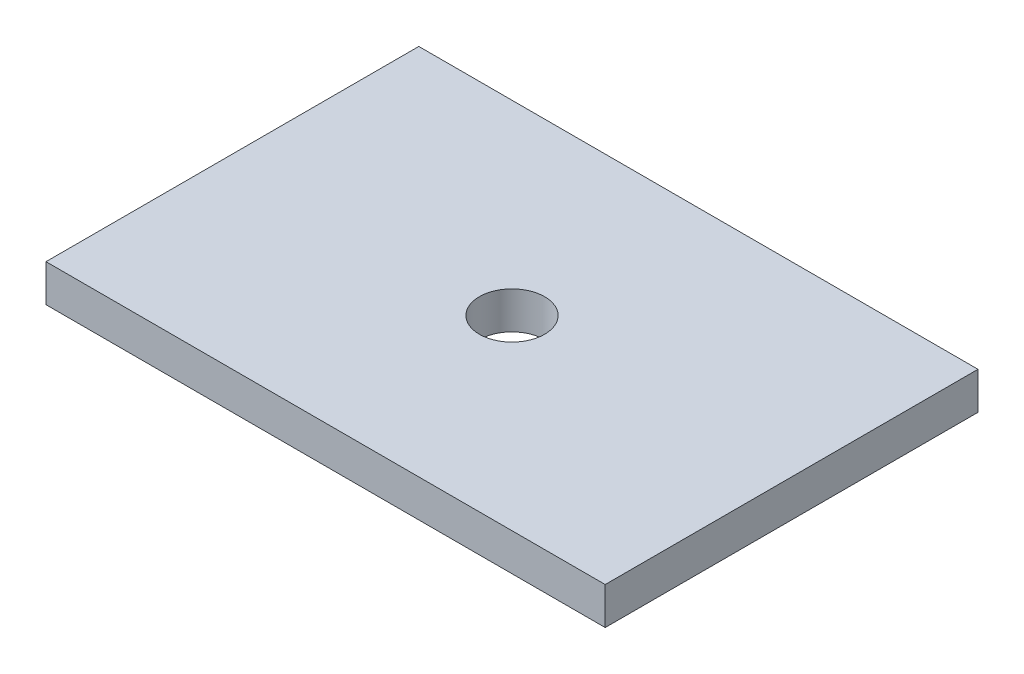
ISO-10303-21;
HEADER;
FILE_DESCRIPTION(('STEP AP214'),'2;1');
FILE_NAME('part.step','',(''),(''),'','','');
FILE_SCHEMA(('AUTOMOTIVE_DESIGN { 1 0 10303 214 1 1 1 1 }'));
ENDSEC;
DATA;
#1=APPLICATION_CONTEXT('core data for automotive mechanical design processes');
#2=APPLICATION_PROTOCOL_DEFINITION('international standard','automotive_design',2000,#1);
#3=PRODUCT_CONTEXT('',#1,'mechanical');
#4=PRODUCT('Part','Part','',(#3));
#5=PRODUCT_RELATED_PRODUCT_CATEGORY('part','',(#4));
#6=PRODUCT_DEFINITION_FORMATION('','',#4);
#7=PRODUCT_DEFINITION_CONTEXT('part definition',#1,'design');
#8=PRODUCT_DEFINITION('design','',#6,#7);
#9=PRODUCT_DEFINITION_SHAPE('','',#8);
#10=(LENGTH_UNIT() NAMED_UNIT(*) SI_UNIT(.MILLI.,.METRE.));
#11=(NAMED_UNIT(*) PLANE_ANGLE_UNIT() SI_UNIT($,.RADIAN.));
#12=(NAMED_UNIT(*) SI_UNIT($,.STERADIAN.) SOLID_ANGLE_UNIT());
#13=UNCERTAINTY_MEASURE_WITH_UNIT(LENGTH_MEASURE(1.E-05),#10,'distance_accuracy_value','');
#14=(GEOMETRIC_REPRESENTATION_CONTEXT(3) GLOBAL_UNCERTAINTY_ASSIGNED_CONTEXT((#13)) GLOBAL_UNIT_ASSIGNED_CONTEXT((#10,
#11,#12)) REPRESENTATION_CONTEXT('',''));
#15=CARTESIAN_POINT('',(0.,0.,0.));
#16=DIRECTION('',(0.,0.,1.));
#17=DIRECTION('',(1.,0.,0.));
#18=AXIS2_PLACEMENT_3D('',#15,#16,#17);
#19=CARTESIAN_POINT('',(15.,2.,10.));
#20=DIRECTION('',(-1.,0.,0.));
#21=DIRECTION('',(0.,0.,1.));
#22=AXIS2_PLACEMENT_3D('',#19,#20,#21);
#23=PLANE('',#22);
#24=DIRECTION('',(0.,0.,-1.));
#25=VECTOR('',#24,1.);
#26=CARTESIAN_POINT('',(15.,0.,10.));
#27=LINE('',#26,#25);
#28=CARTESIAN_POINT('',(15.,0.,10.));
#29=VERTEX_POINT('',#28);
#30=CARTESIAN_POINT('',(15.,0.,-10.));
#31=VERTEX_POINT('',#30);
#32=EDGE_CURVE('E96',#29,#31,#27,.T.);
#33=ORIENTED_EDGE('',*,*,#32,.T.);
#34=DIRECTION('',(0.,-1.,0.));
#35=VECTOR('',#34,1.);
#36=CARTESIAN_POINT('',(15.,2.,-10.));
#37=LINE('',#36,#35);
#38=CARTESIAN_POINT('',(15.,2.,-10.));
#39=VERTEX_POINT('',#38);
#40=EDGE_CURVE('E11',#39,#31,#37,.T.);
#41=ORIENTED_EDGE('',*,*,#40,.F.);
#42=DIRECTION('',(0.,0.,-1.));
#43=VECTOR('',#42,1.);
#44=CARTESIAN_POINT('',(15.,2.,10.));
#45=LINE('',#44,#43);
#46=CARTESIAN_POINT('',(15.,2.,10.));
#47=VERTEX_POINT('',#46);
#48=EDGE_CURVE('E84',#47,#39,#45,.T.);
#49=ORIENTED_EDGE('',*,*,#48,.F.);
#50=DIRECTION('',(0.,-1.,0.));
#51=VECTOR('',#50,1.);
#52=CARTESIAN_POINT('',(15.,2.,10.));
#53=LINE('',#52,#51);
#54=EDGE_CURVE('E92',#47,#29,#53,.T.);
#55=ORIENTED_EDGE('',*,*,#54,.T.);
#56=EDGE_LOOP('',(#33,#41,#49,#55));
#57=FACE_BOUND('',#56,.T.);
#58=ADVANCED_FACE('F33',(#57),#23,.F.);
#59=CARTESIAN_POINT('',(-15.,2.,-10.));
#60=DIRECTION('',(0.,0.,1.));
#61=DIRECTION('',(1.,0.,0.));
#62=AXIS2_PLACEMENT_3D('',#59,#60,#61);
#63=PLANE('',#62);
#64=DIRECTION('',(-1.,0.,0.));
#65=VECTOR('',#64,1.);
#66=CARTESIAN_POINT('',(-15.,0.,-10.));
#67=LINE('',#66,#65);
#68=CARTESIAN_POINT('',(-15.,0.,-10.));
#69=VERTEX_POINT('',#68);
#70=EDGE_CURVE('E88',#31,#69,#67,.T.);
#71=ORIENTED_EDGE('',*,*,#70,.T.);
#72=DIRECTION('',(0.,-1.,0.));
#73=VECTOR('',#72,1.);
#74=CARTESIAN_POINT('',(-15.,2.,-10.));
#75=LINE('',#74,#73);
#76=CARTESIAN_POINT('',(-15.,2.,-10.));
#77=VERTEX_POINT('',#76);
#78=EDGE_CURVE('E41',#77,#69,#75,.T.);
#79=ORIENTED_EDGE('',*,*,#78,.F.);
#80=DIRECTION('',(-1.,0.,0.));
#81=VECTOR('',#80,1.);
#82=CARTESIAN_POINT('',(-15.,2.,-10.));
#83=LINE('',#82,#81);
#84=EDGE_CURVE('E79',#39,#77,#83,.T.);
#85=ORIENTED_EDGE('',*,*,#84,.F.);
#86=ORIENTED_EDGE('',*,*,#40,.T.);
#87=EDGE_LOOP('',(#71,#79,#85,#86));
#88=FACE_BOUND('',#87,.T.);
#89=ADVANCED_FACE('F87',(#88),#63,.F.);
#90=CARTESIAN_POINT('',(-15.,2.,10.));
#91=DIRECTION('',(1.,0.,0.));
#92=DIRECTION('',(0.,0.,-1.));
#93=AXIS2_PLACEMENT_3D('',#90,#91,#92);
#94=PLANE('',#93);
#95=DIRECTION('',(0.,0.,1.));
#96=VECTOR('',#95,1.);
#97=CARTESIAN_POINT('',(-15.,0.,10.));
#98=LINE('',#97,#96);
#99=CARTESIAN_POINT('',(-15.,0.,10.));
#100=VERTEX_POINT('',#99);
#101=EDGE_CURVE('E66',#69,#100,#98,.T.);
#102=ORIENTED_EDGE('',*,*,#101,.T.);
#103=DIRECTION('',(0.,-1.,0.));
#104=VECTOR('',#103,1.);
#105=CARTESIAN_POINT('',(-15.,2.,10.));
#106=LINE('',#105,#104);
#107=CARTESIAN_POINT('',(-15.,2.,10.));
#108=VERTEX_POINT('',#107);
#109=EDGE_CURVE('E89',#108,#100,#106,.T.);
#110=ORIENTED_EDGE('',*,*,#109,.F.);
#111=DIRECTION('',(0.,0.,1.));
#112=VECTOR('',#111,1.);
#113=CARTESIAN_POINT('',(-15.,2.,10.));
#114=LINE('',#113,#112);
#115=EDGE_CURVE('E82',#77,#108,#114,.T.);
#116=ORIENTED_EDGE('',*,*,#115,.F.);
#117=ORIENTED_EDGE('',*,*,#78,.T.);
#118=EDGE_LOOP('',(#102,#110,#116,#117));
#119=FACE_BOUND('',#118,.T.);
#120=ADVANCED_FACE('F90',(#119),#94,.F.);
#121=CARTESIAN_POINT('',(-15.,2.,10.));
#122=DIRECTION('',(0.,0.,-1.));
#123=DIRECTION('',(-1.,0.,0.));
#124=AXIS2_PLACEMENT_3D('',#121,#122,#123);
#125=PLANE('',#124);
#126=DIRECTION('',(1.,0.,0.));
#127=VECTOR('',#126,1.);
#128=CARTESIAN_POINT('',(-15.,0.,10.));
#129=LINE('',#128,#127);
#130=EDGE_CURVE('E72',#100,#29,#129,.T.);
#131=ORIENTED_EDGE('',*,*,#130,.T.);
#132=ORIENTED_EDGE('',*,*,#54,.F.);
#133=DIRECTION('',(1.,0.,0.));
#134=VECTOR('',#133,1.);
#135=CARTESIAN_POINT('',(-15.,2.,10.));
#136=LINE('',#135,#134);
#137=EDGE_CURVE('E49',#108,#47,#136,.T.);
#138=ORIENTED_EDGE('',*,*,#137,.F.);
#139=ORIENTED_EDGE('',*,*,#109,.T.);
#140=EDGE_LOOP('',(#131,#132,#138,#139));
#141=FACE_BOUND('',#140,.T.);
#142=ADVANCED_FACE('F104',(#141),#125,.F.);
#143=CARTESIAN_POINT('',(0.,2.,0.));
#144=DIRECTION('',(0.,-1.,0.));
#145=DIRECTION('',(0.,0.,-1.));
#146=AXIS2_PLACEMENT_3D('',#143,#144,#145);
#147=PLANE('',#146);
#148=CARTESIAN_POINT('',(0.,2.,0.));
#149=DIRECTION('',(0.,1.,0.));
#150=DIRECTION('',(0.,0.,1.));
#151=AXIS2_PLACEMENT_3D('',#148,#149,#150);
#152=CIRCLE('',#151,1.75);
#153=CARTESIAN_POINT('',(0.,2.,1.75));
#154=VERTEX_POINT('',#153);
#155=EDGE_CURVE('E110',#154,#154,#152,.T.);
#156=ORIENTED_EDGE('',*,*,#155,.F.);
#157=EDGE_LOOP('',(#156));
#158=FACE_BOUND('',#157,.T.);
#159=ORIENTED_EDGE('',*,*,#48,.T.);
#160=ORIENTED_EDGE('',*,*,#84,.T.);
#161=ORIENTED_EDGE('',*,*,#115,.T.);
#162=ORIENTED_EDGE('',*,*,#137,.T.);
#163=EDGE_LOOP('',(#159,#160,#161,#162));
#164=FACE_BOUND('',#163,.T.);
#165=ADVANCED_FACE('F80',(#158,#164),#147,.F.);
#166=CARTESIAN_POINT('',(0.,0.,0.));
#167=DIRECTION('',(0.,-1.,0.));
#168=DIRECTION('',(0.,0.,-1.));
#169=AXIS2_PLACEMENT_3D('',#166,#167,#168);
#170=PLANE('',#169);
#171=CARTESIAN_POINT('',(0.,0.,0.));
#172=DIRECTION('',(0.,1.,0.));
#173=DIRECTION('',(0.,0.,1.));
#174=AXIS2_PLACEMENT_3D('',#171,#172,#173);
#175=CIRCLE('',#174,1.75);
#176=CARTESIAN_POINT('',(0.,0.,1.75));
#177=VERTEX_POINT('',#176);
#178=EDGE_CURVE('E99',#177,#177,#175,.T.);
#179=ORIENTED_EDGE('',*,*,#178,.T.);
#180=EDGE_LOOP('',(#179));
#181=FACE_BOUND('',#180,.T.);
#182=ORIENTED_EDGE('',*,*,#32,.F.);
#183=ORIENTED_EDGE('',*,*,#130,.F.);
#184=ORIENTED_EDGE('',*,*,#101,.F.);
#185=ORIENTED_EDGE('',*,*,#70,.F.);
#186=EDGE_LOOP('',(#182,#183,#184,#185));
#187=FACE_BOUND('',#186,.T.);
#188=ADVANCED_FACE('F107',(#181,#187),#170,.T.);
#189=CARTESIAN_POINT('',(0.,0.,0.));
#190=DIRECTION('',(0.,1.,0.));
#191=DIRECTION('',(0.,0.,1.));
#192=AXIS2_PLACEMENT_3D('',#189,#190,#191);
#193=CYLINDRICAL_SURFACE('',#192,1.75);
#194=ORIENTED_EDGE('',*,*,#178,.F.);
#195=EDGE_LOOP('',(#194));
#196=FACE_BOUND('',#195,.T.);
#197=ORIENTED_EDGE('',*,*,#155,.T.);
#198=EDGE_LOOP('',(#197));
#199=FACE_BOUND('',#198,.T.);
#200=ADVANCED_FACE('F117',(#196,#199),#193,.F.);
#201=CLOSED_SHELL('',(#58,#89,#120,#142,#165,#188,#200));
#202=MANIFOLD_SOLID_BREP('B2',#201);
#203=ADVANCED_BREP_SHAPE_REPRESENTATION('',(#18,#202),#14);
#204=SHAPE_DEFINITION_REPRESENTATION(#9,#203);
ENDSEC;
END-ISO-10303-21;
